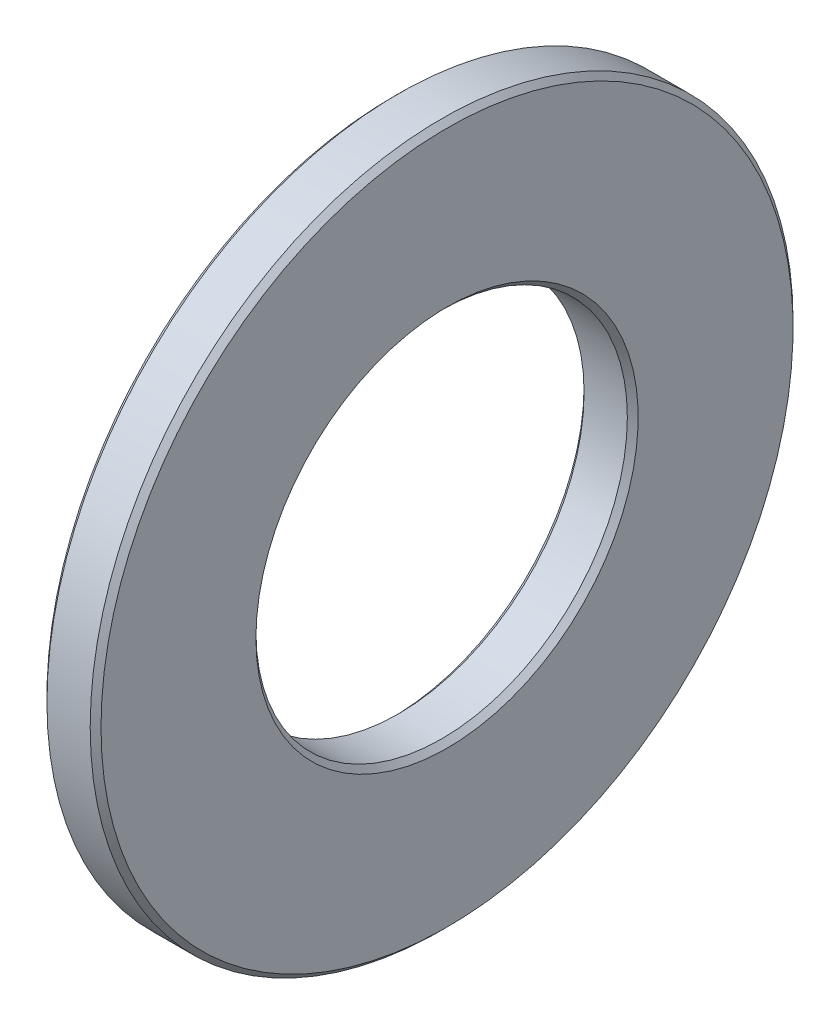
ISO-10303-21;
HEADER;
FILE_DESCRIPTION(('STEP AP214'),'2;1');
FILE_NAME('part.step','',(''),(''),'','','');
FILE_SCHEMA(('AUTOMOTIVE_DESIGN { 1 0 10303 214 1 1 1 1 }'));
ENDSEC;
DATA;
#1=APPLICATION_CONTEXT('core data for automotive mechanical design processes');
#2=APPLICATION_PROTOCOL_DEFINITION('international standard','automotive_design',2000,#1);
#3=PRODUCT_CONTEXT('',#1,'mechanical');
#4=PRODUCT('Part','Part','',(#3));
#5=PRODUCT_RELATED_PRODUCT_CATEGORY('part','',(#4));
#6=PRODUCT_DEFINITION_FORMATION('','',#4);
#7=PRODUCT_DEFINITION_CONTEXT('part definition',#1,'design');
#8=PRODUCT_DEFINITION('design','',#6,#7);
#9=PRODUCT_DEFINITION_SHAPE('','',#8);
#10=(LENGTH_UNIT() NAMED_UNIT(*) SI_UNIT(.MILLI.,.METRE.));
#11=(NAMED_UNIT(*) PLANE_ANGLE_UNIT() SI_UNIT($,.RADIAN.));
#12=(NAMED_UNIT(*) SI_UNIT($,.STERADIAN.) SOLID_ANGLE_UNIT());
#13=UNCERTAINTY_MEASURE_WITH_UNIT(LENGTH_MEASURE(1.E-05),#10,'distance_accuracy_value','');
#14=(GEOMETRIC_REPRESENTATION_CONTEXT(3) GLOBAL_UNCERTAINTY_ASSIGNED_CONTEXT((#13)) GLOBAL_UNIT_ASSIGNED_CONTEXT((#10,
#11,#12)) REPRESENTATION_CONTEXT('',''));
#15=CARTESIAN_POINT('',(0.,0.,0.));
#16=DIRECTION('',(0.,0.,1.));
#17=DIRECTION('',(1.,0.,0.));
#18=AXIS2_PLACEMENT_3D('',#15,#16,#17);
#19=CARTESIAN_POINT('',(-34.9249999999999,0.,0.));
#20=DIRECTION('',(-1.,0.,0.));
#21=DIRECTION('',(0.,0.,1.));
#22=AXIS2_PLACEMENT_3D('',#19,#20,#21);
#23=CYLINDRICAL_SURFACE('',#22,3.435);
#24=CARTESIAN_POINT('',(-0.0999999999999959,0.,0.));
#25=DIRECTION('',(-1.,0.,0.));
#26=DIRECTION('',(0.,0.,1.));
#27=AXIS2_PLACEMENT_3D('',#24,#25,#26);
#28=CIRCLE('',#27,3.435);
#29=CARTESIAN_POINT('',(-0.0999999999999959,0.,3.435));
#30=VERTEX_POINT('',#29);
#31=EDGE_CURVE('E68',#30,#30,#28,.F.);
#32=ORIENTED_EDGE('',*,*,#31,.T.);
#33=EDGE_LOOP('',(#32));
#34=FACE_BOUND('',#33,.T.);
#35=CARTESIAN_POINT('',(-0.900000000000006,0.,0.));
#36=DIRECTION('',(1.,0.,0.));
#37=DIRECTION('',(0.,0.,-1.));
#38=AXIS2_PLACEMENT_3D('',#35,#36,#37);
#39=CIRCLE('',#38,3.435);
#40=CARTESIAN_POINT('',(-0.900000000000006,0.,-3.435));
#41=VERTEX_POINT('',#40);
#42=EDGE_CURVE('E53',#41,#41,#39,.F.);
#43=ORIENTED_EDGE('',*,*,#42,.T.);
#44=EDGE_LOOP('',(#43));
#45=FACE_BOUND('',#44,.T.);
#46=ADVANCED_FACE('F48',(#34,#45),#23,.F.);
#47=CARTESIAN_POINT('',(0.,3.435,0.));
#48=DIRECTION('',(-1.,0.,0.));
#49=DIRECTION('',(0.,0.,1.));
#50=AXIS2_PLACEMENT_3D('',#47,#48,#49);
#51=PLANE('',#50);
#52=CARTESIAN_POINT('',(0.,0.,0.));
#53=DIRECTION('',(-1.,0.,0.));
#54=DIRECTION('',(0.,0.,1.));
#55=AXIS2_PLACEMENT_3D('',#52,#53,#54);
#56=CIRCLE('',#55,3.535);
#57=CARTESIAN_POINT('',(0.,0.,3.535));
#58=VERTEX_POINT('',#57);
#59=EDGE_CURVE('E76',#58,#58,#56,.T.);
#60=ORIENTED_EDGE('',*,*,#59,.T.);
#61=EDGE_LOOP('',(#60));
#62=FACE_BOUND('',#61,.T.);
#63=CARTESIAN_POINT('',(0.,0.,0.));
#64=DIRECTION('',(-1.,0.,0.));
#65=DIRECTION('',(0.,0.,1.));
#66=AXIS2_PLACEMENT_3D('',#63,#64,#65);
#67=CIRCLE('',#66,6.4);
#68=CARTESIAN_POINT('',(0.,0.,6.4));
#69=VERTEX_POINT('',#68);
#70=EDGE_CURVE('E80',#69,#69,#67,.F.);
#71=ORIENTED_EDGE('',*,*,#70,.T.);
#72=EDGE_LOOP('',(#71));
#73=FACE_BOUND('',#72,.T.);
#74=ADVANCED_FACE('F84',(#62,#73),#51,.F.);
#75=CARTESIAN_POINT('',(-34.9249999999999,0.,0.));
#76=DIRECTION('',(-1.,0.,0.));
#77=DIRECTION('',(0.,0.,1.));
#78=AXIS2_PLACEMENT_3D('',#75,#76,#77);
#79=CYLINDRICAL_SURFACE('',#78,6.5);
#80=CARTESIAN_POINT('',(-0.100000000000003,0.,0.));
#81=DIRECTION('',(-1.,0.,0.));
#82=DIRECTION('',(0.,0.,1.));
#83=AXIS2_PLACEMENT_3D('',#80,#81,#82);
#84=CIRCLE('',#83,6.5);
#85=CARTESIAN_POINT('',(-0.100000000000003,0.,6.5));
#86=VERTEX_POINT('',#85);
#87=EDGE_CURVE('E62',#86,#86,#84,.T.);
#88=ORIENTED_EDGE('',*,*,#87,.T.);
#89=EDGE_LOOP('',(#88));
#90=FACE_BOUND('',#89,.T.);
#91=CARTESIAN_POINT('',(-0.899999999999999,0.,0.));
#92=DIRECTION('',(1.,0.,0.));
#93=DIRECTION('',(0.,0.,-1.));
#94=AXIS2_PLACEMENT_3D('',#91,#92,#93);
#95=CIRCLE('',#94,6.5);
#96=CARTESIAN_POINT('',(-0.899999999999999,0.,-6.5));
#97=VERTEX_POINT('',#96);
#98=EDGE_CURVE('E66',#97,#97,#95,.T.);
#99=ORIENTED_EDGE('',*,*,#98,.T.);
#100=EDGE_LOOP('',(#99));
#101=FACE_BOUND('',#100,.T.);
#102=ADVANCED_FACE('F94',(#90,#101),#79,.T.);
#103=CARTESIAN_POINT('',(-1.,6.5,0.));
#104=DIRECTION('',(1.,0.,0.));
#105=DIRECTION('',(0.,0.,-1.));
#106=AXIS2_PLACEMENT_3D('',#103,#104,#105);
#107=PLANE('',#106);
#108=CARTESIAN_POINT('',(-1.,0.,0.));
#109=DIRECTION('',(1.,0.,0.));
#110=DIRECTION('',(0.,0.,-1.));
#111=AXIS2_PLACEMENT_3D('',#108,#109,#110);
#112=CIRCLE('',#111,6.4);
#113=CARTESIAN_POINT('',(-1.,0.,-6.4));
#114=VERTEX_POINT('',#113);
#115=EDGE_CURVE('E11',#114,#114,#112,.F.);
#116=ORIENTED_EDGE('',*,*,#115,.T.);
#117=EDGE_LOOP('',(#116));
#118=FACE_BOUND('',#117,.T.);
#119=CARTESIAN_POINT('',(-1.,0.,0.));
#120=DIRECTION('',(1.,0.,0.));
#121=DIRECTION('',(0.,0.,-1.));
#122=AXIS2_PLACEMENT_3D('',#119,#120,#121);
#123=CIRCLE('',#122,3.535);
#124=CARTESIAN_POINT('',(-1.,0.,-3.535));
#125=VERTEX_POINT('',#124);
#126=EDGE_CURVE('E57',#125,#125,#123,.T.);
#127=ORIENTED_EDGE('',*,*,#126,.T.);
#128=EDGE_LOOP('',(#127));
#129=FACE_BOUND('',#128,.T.);
#130=ADVANCED_FACE('F96',(#118,#129),#107,.F.);
#131=CARTESIAN_POINT('',(0.,0.,0.));
#132=DIRECTION('',(1.,0.,0.));
#133=DIRECTION('',(0.,0.,-1.));
#134=AXIS2_PLACEMENT_3D('',#131,#132,#133);
#135=CONICAL_SURFACE('',#134,3.535,0.78539816339745);
#136=ORIENTED_EDGE('',*,*,#31,.F.);
#137=EDGE_LOOP('',(#136));
#138=FACE_BOUND('',#137,.T.);
#139=ORIENTED_EDGE('',*,*,#59,.F.);
#140=EDGE_LOOP('',(#139));
#141=FACE_BOUND('',#140,.T.);
#142=ADVANCED_FACE('F90',(#138,#141),#135,.F.);
#143=CARTESIAN_POINT('',(-0.100000000000003,0.,0.));
#144=DIRECTION('',(-1.,0.,0.));
#145=DIRECTION('',(0.,0.,1.));
#146=AXIS2_PLACEMENT_3D('',#143,#144,#145);
#147=CONICAL_SURFACE('',#146,6.5,0.785398163397448);
#148=ORIENTED_EDGE('',*,*,#70,.F.);
#149=EDGE_LOOP('',(#148));
#150=FACE_BOUND('',#149,.T.);
#151=ORIENTED_EDGE('',*,*,#87,.F.);
#152=EDGE_LOOP('',(#151));
#153=FACE_BOUND('',#152,.T.);
#154=ADVANCED_FACE('F86',(#150,#153),#147,.T.);
#155=CARTESIAN_POINT('',(-1.,0.,0.));
#156=DIRECTION('',(1.,0.,0.));
#157=DIRECTION('',(0.,0.,-1.));
#158=AXIS2_PLACEMENT_3D('',#155,#156,#157);
#159=CONICAL_SURFACE('',#158,6.4,0.785398163397427);
#160=ORIENTED_EDGE('',*,*,#98,.F.);
#161=EDGE_LOOP('',(#160));
#162=FACE_BOUND('',#161,.T.);
#163=ORIENTED_EDGE('',*,*,#115,.F.);
#164=EDGE_LOOP('',(#163));
#165=FACE_BOUND('',#164,.T.);
#166=ADVANCED_FACE('F89',(#162,#165),#159,.T.);
#167=CARTESIAN_POINT('',(-0.900000000000006,0.,0.));
#168=DIRECTION('',(-1.,0.,0.));
#169=DIRECTION('',(0.,0.,1.));
#170=AXIS2_PLACEMENT_3D('',#167,#168,#169);
#171=CONICAL_SURFACE('',#170,3.435,0.78539816339745);
#172=ORIENTED_EDGE('',*,*,#126,.F.);
#173=EDGE_LOOP('',(#172));
#174=FACE_BOUND('',#173,.T.);
#175=ORIENTED_EDGE('',*,*,#42,.F.);
#176=EDGE_LOOP('',(#175));
#177=FACE_BOUND('',#176,.T.);
#178=ADVANCED_FACE('F51',(#174,#177),#171,.F.);
#179=CLOSED_SHELL('',(#46,#74,#102,#130,#142,#154,#166,#178));
#180=MANIFOLD_SOLID_BREP('B2',#179);
#181=ADVANCED_BREP_SHAPE_REPRESENTATION('',(#18,#180),#14);
#182=SHAPE_DEFINITION_REPRESENTATION(#9,#181);
ENDSEC;
END-ISO-10303-21;
